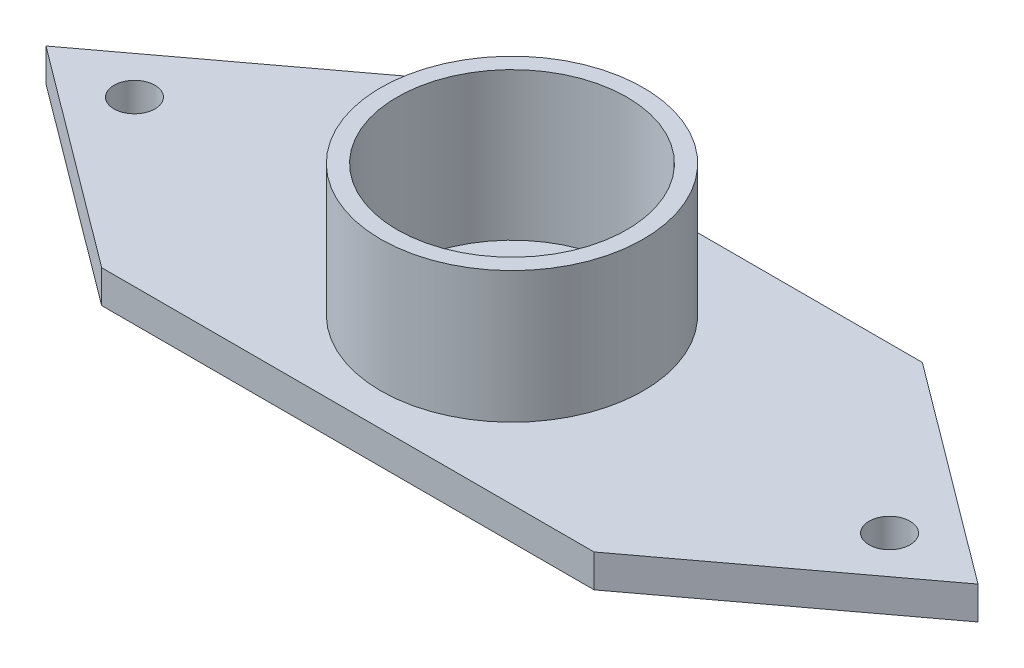
ISO-10303-21;
HEADER;
FILE_DESCRIPTION(('STEP AP214'),'2;1');
FILE_NAME('part.step','',(''),(''),'','','');
FILE_SCHEMA(('AUTOMOTIVE_DESIGN { 1 0 10303 214 1 1 1 1 }'));
ENDSEC;
DATA;
#1=APPLICATION_CONTEXT('core data for automotive mechanical design processes');
#2=APPLICATION_PROTOCOL_DEFINITION('international standard','automotive_design',2000,#1);
#3=PRODUCT_CONTEXT('',#1,'mechanical');
#4=PRODUCT('Part','Part','',(#3));
#5=PRODUCT_RELATED_PRODUCT_CATEGORY('part','',(#4));
#6=PRODUCT_DEFINITION_FORMATION('','',#4);
#7=PRODUCT_DEFINITION_CONTEXT('part definition',#1,'design');
#8=PRODUCT_DEFINITION('design','',#6,#7);
#9=PRODUCT_DEFINITION_SHAPE('','',#8);
#10=(LENGTH_UNIT() NAMED_UNIT(*) SI_UNIT(.MILLI.,.METRE.));
#11=(NAMED_UNIT(*) PLANE_ANGLE_UNIT() SI_UNIT($,.RADIAN.));
#12=(NAMED_UNIT(*) SI_UNIT($,.STERADIAN.) SOLID_ANGLE_UNIT());
#13=UNCERTAINTY_MEASURE_WITH_UNIT(LENGTH_MEASURE(1.E-05),#10,'distance_accuracy_value','');
#14=(GEOMETRIC_REPRESENTATION_CONTEXT(3) GLOBAL_UNCERTAINTY_ASSIGNED_CONTEXT((#13)) GLOBAL_UNIT_ASSIGNED_CONTEXT((#10,
#11,#12)) REPRESENTATION_CONTEXT('',''));
#15=CARTESIAN_POINT('',(0.,0.,0.));
#16=DIRECTION('',(0.,0.,1.));
#17=DIRECTION('',(1.,0.,0.));
#18=AXIS2_PLACEMENT_3D('',#15,#16,#17);
#19=CARTESIAN_POINT('',(10.7416276220772,2.,14.3828461957619));
#20=DIRECTION('',(-0.59837634818669,0.,-0.801215168310462));
#21=DIRECTION('',(-0.801215168310461,0.,0.59837634818669));
#22=AXIS2_PLACEMENT_3D('',#19,#20,#21);
#23=PLANE('',#22);
#24=DIRECTION('',(0.801215168310461,0.,-0.59837634818669));
#25=VECTOR('',#24,1.);
#26=CARTESIAN_POINT('',(10.7416276220772,0.,14.3828461957619));
#27=LINE('',#26,#25);
#28=CARTESIAN_POINT('',(30.,0.,0.));
#29=VERTEX_POINT('',#28);
#30=CARTESIAN_POINT('',(43.3898201481133,0.,-10.));
#31=VERTEX_POINT('',#30);
#32=EDGE_CURVE('E130',#29,#31,#27,.T.);
#33=ORIENTED_EDGE('',*,*,#32,.T.);
#34=DIRECTION('',(0.,-1.,0.));
#35=VECTOR('',#34,1.);
#36=CARTESIAN_POINT('',(43.3898201481133,2.,-10.));
#37=LINE('',#36,#35);
#38=CARTESIAN_POINT('',(43.3898201481133,2.,-10.));
#39=VERTEX_POINT('',#38);
#40=EDGE_CURVE('E11',#39,#31,#37,.T.);
#41=ORIENTED_EDGE('',*,*,#40,.F.);
#42=DIRECTION('',(0.801215168310461,0.,-0.59837634818669));
#43=VECTOR('',#42,1.);
#44=CARTESIAN_POINT('',(10.7416276220772,2.,14.3828461957619));
#45=LINE('',#44,#43);
#46=CARTESIAN_POINT('',(30.,2.,0.));
#47=VERTEX_POINT('',#46);
#48=EDGE_CURVE('E143',#47,#39,#45,.T.);
#49=ORIENTED_EDGE('',*,*,#48,.F.);
#50=DIRECTION('',(0.,-1.,0.));
#51=VECTOR('',#50,1.);
#52=CARTESIAN_POINT('',(30.,2.,0.));
#53=LINE('',#52,#51);
#54=EDGE_CURVE('E126',#47,#29,#53,.T.);
#55=ORIENTED_EDGE('',*,*,#54,.T.);
#56=EDGE_LOOP('',(#33,#41,#49,#55));
#57=FACE_BOUND('',#56,.T.);
#58=ADVANCED_FACE('F45',(#57),#23,.F.);
#59=CARTESIAN_POINT('',(20.3301917525851,2.,-27.2217611143772));
#60=DIRECTION('',(-0.59837634818669,0.,0.801215168310462));
#61=DIRECTION('',(0.801215168310461,0.,0.59837634818669));
#62=AXIS2_PLACEMENT_3D('',#59,#60,#61);
#63=PLANE('',#62);
#64=DIRECTION('',(-0.801215168310461,0.,-0.59837634818669));
#65=VECTOR('',#64,1.);
#66=CARTESIAN_POINT('',(20.3301917525851,0.,-27.2217611143772));
#67=LINE('',#66,#65);
#68=CARTESIAN_POINT('',(30.,0.,-20.));
#69=VERTEX_POINT('',#68);
#70=EDGE_CURVE('E133',#31,#69,#67,.T.);
#71=ORIENTED_EDGE('',*,*,#70,.T.);
#72=DIRECTION('',(0.,-1.,0.));
#73=VECTOR('',#72,1.);
#74=CARTESIAN_POINT('',(30.,2.,-20.));
#75=LINE('',#74,#73);
#76=CARTESIAN_POINT('',(30.,2.,-20.));
#77=VERTEX_POINT('',#76);
#78=EDGE_CURVE('E54',#77,#69,#75,.T.);
#79=ORIENTED_EDGE('',*,*,#78,.F.);
#80=DIRECTION('',(-0.801215168310461,0.,-0.59837634818669));
#81=VECTOR('',#80,1.);
#82=CARTESIAN_POINT('',(20.3301917525851,2.,-27.2217611143772));
#83=LINE('',#82,#81);
#84=EDGE_CURVE('E100',#39,#77,#83,.T.);
#85=ORIENTED_EDGE('',*,*,#84,.F.);
#86=ORIENTED_EDGE('',*,*,#40,.T.);
#87=EDGE_LOOP('',(#71,#79,#85,#86));
#88=FACE_BOUND('',#87,.T.);
#89=ADVANCED_FACE('F194',(#88),#63,.F.);
#90=CARTESIAN_POINT('',(0.,2.,-20.));
#91=DIRECTION('',(0.,0.,-1.));
#92=DIRECTION('',(-1.,0.,0.));
#93=AXIS2_PLACEMENT_3D('',#90,#91,#92);
#94=PLANE('',#93);
#95=DIRECTION('',(1.,0.,0.));
#96=VECTOR('',#95,1.);
#97=CARTESIAN_POINT('',(0.,0.,-20.));
#98=LINE('',#97,#96);
#99=CARTESIAN_POINT('',(0.,0.,-20.));
#100=VERTEX_POINT('',#99);
#101=EDGE_CURVE('E137',#100,#69,#98,.T.);
#102=ORIENTED_EDGE('',*,*,#101,.F.);
#103=DIRECTION('',(0.,-1.,0.));
#104=VECTOR('',#103,1.);
#105=CARTESIAN_POINT('',(0.,2.,-20.));
#106=LINE('',#105,#104);
#107=CARTESIAN_POINT('',(0.,2.,-20.));
#108=VERTEX_POINT('',#107);
#109=EDGE_CURVE('E121',#108,#100,#106,.T.);
#110=ORIENTED_EDGE('',*,*,#109,.F.);
#111=DIRECTION('',(1.,0.,0.));
#112=VECTOR('',#111,1.);
#113=CARTESIAN_POINT('',(0.,2.,-20.));
#114=LINE('',#113,#112);
#115=EDGE_CURVE('E114',#108,#77,#114,.T.);
#116=ORIENTED_EDGE('',*,*,#115,.T.);
#117=ORIENTED_EDGE('',*,*,#78,.T.);
#118=EDGE_LOOP('',(#102,#110,#116,#117));
#119=FACE_BOUND('',#118,.T.);
#120=ADVANCED_FACE('F174',(#119),#94,.T.);
#121=CARTESIAN_POINT('',(-9.58856413050796,2.,-12.8389149186152));
#122=DIRECTION('',(0.59837634818669,0.,0.801215168310462));
#123=DIRECTION('',(0.801215168310461,0.,-0.59837634818669));
#124=AXIS2_PLACEMENT_3D('',#121,#122,#123);
#125=PLANE('',#124);
#126=DIRECTION('',(-0.801215168310461,0.,0.59837634818669));
#127=VECTOR('',#126,1.);
#128=CARTESIAN_POINT('',(-9.58856413050796,0.,-12.8389149186152));
#129=LINE('',#128,#127);
#130=CARTESIAN_POINT('',(-13.3898201481133,0.,-10.));
#131=VERTEX_POINT('',#130);
#132=EDGE_CURVE('E120',#100,#131,#129,.T.);
#133=ORIENTED_EDGE('',*,*,#132,.T.);
#134=DIRECTION('',(0.,-1.,0.));
#135=VECTOR('',#134,1.);
#136=CARTESIAN_POINT('',(-13.3898201481133,2.,-10.));
#137=LINE('',#136,#135);
#138=CARTESIAN_POINT('',(-13.3898201481133,2.,-10.));
#139=VERTEX_POINT('',#138);
#140=EDGE_CURVE('E117',#139,#131,#137,.T.);
#141=ORIENTED_EDGE('',*,*,#140,.F.);
#142=DIRECTION('',(-0.801215168310461,0.,0.59837634818669));
#143=VECTOR('',#142,1.);
#144=CARTESIAN_POINT('',(-9.58856413050796,2.,-12.8389149186152));
#145=LINE('',#144,#143);
#146=EDGE_CURVE('E108',#108,#139,#145,.T.);
#147=ORIENTED_EDGE('',*,*,#146,.F.);
#148=ORIENTED_EDGE('',*,*,#109,.T.);
#149=EDGE_LOOP('',(#133,#141,#147,#148));
#150=FACE_BOUND('',#149,.T.);
#151=ADVANCED_FACE('F118',(#150),#125,.F.);
#152=CARTESIAN_POINT('',(0.,2.,0.));
#153=DIRECTION('',(0.59837634818669,0.,-0.801215168310462));
#154=DIRECTION('',(-0.801215168310461,0.,-0.59837634818669));
#155=AXIS2_PLACEMENT_3D('',#152,#153,#154);
#156=PLANE('',#155);
#157=DIRECTION('',(0.801215168310461,0.,0.59837634818669));
#158=VECTOR('',#157,1.);
#159=CARTESIAN_POINT('',(0.,0.,0.));
#160=LINE('',#159,#158);
#161=CARTESIAN_POINT('',(0.,0.,0.));
#162=VERTEX_POINT('',#161);
#163=EDGE_CURVE('E86',#131,#162,#160,.T.);
#164=ORIENTED_EDGE('',*,*,#163,.T.);
#165=DIRECTION('',(0.,-1.,0.));
#166=VECTOR('',#165,1.);
#167=CARTESIAN_POINT('',(0.,2.,0.));
#168=LINE('',#167,#166);
#169=CARTESIAN_POINT('',(0.,2.,0.));
#170=VERTEX_POINT('',#169);
#171=EDGE_CURVE('E122',#170,#162,#168,.T.);
#172=ORIENTED_EDGE('',*,*,#171,.F.);
#173=DIRECTION('',(0.801215168310461,0.,0.59837634818669));
#174=VECTOR('',#173,1.);
#175=CARTESIAN_POINT('',(0.,2.,0.));
#176=LINE('',#175,#174);
#177=EDGE_CURVE('E112',#139,#170,#176,.T.);
#178=ORIENTED_EDGE('',*,*,#177,.F.);
#179=ORIENTED_EDGE('',*,*,#140,.T.);
#180=EDGE_LOOP('',(#164,#172,#178,#179));
#181=FACE_BOUND('',#180,.T.);
#182=ADVANCED_FACE('F124',(#181),#156,.F.);
#183=CARTESIAN_POINT('',(0.,2.,0.));
#184=DIRECTION('',(0.,0.,-1.));
#185=DIRECTION('',(-1.,0.,0.));
#186=AXIS2_PLACEMENT_3D('',#183,#184,#185);
#187=PLANE('',#186);
#188=DIRECTION('',(1.,0.,0.));
#189=VECTOR('',#188,1.);
#190=CARTESIAN_POINT('',(0.,0.,0.));
#191=LINE('',#190,#189);
#192=EDGE_CURVE('E92',#162,#29,#191,.T.);
#193=ORIENTED_EDGE('',*,*,#192,.T.);
#194=ORIENTED_EDGE('',*,*,#54,.F.);
#195=DIRECTION('',(1.,0.,0.));
#196=VECTOR('',#195,1.);
#197=CARTESIAN_POINT('',(0.,2.,0.));
#198=LINE('',#197,#196);
#199=EDGE_CURVE('E63',#170,#47,#198,.T.);
#200=ORIENTED_EDGE('',*,*,#199,.F.);
#201=ORIENTED_EDGE('',*,*,#171,.T.);
#202=EDGE_LOOP('',(#193,#194,#200,#201));
#203=FACE_BOUND('',#202,.T.);
#204=ADVANCED_FACE('F181',(#203),#187,.F.);
#205=CARTESIAN_POINT('',(0.,2.,0.));
#206=DIRECTION('',(0.,1.,0.));
#207=DIRECTION('',(0.,0.,1.));
#208=AXIS2_PLACEMENT_3D('',#205,#206,#207);
#209=PLANE('',#208);
#210=CARTESIAN_POINT('',(38.,2.,-10.));
#211=DIRECTION('',(0.,1.,0.));
#212=DIRECTION('',(0.,0.,1.));
#213=AXIS2_PLACEMENT_3D('',#210,#211,#212);
#214=CIRCLE('',#213,1.25000000000001);
#215=CARTESIAN_POINT('',(38.,2.,-8.75));
#216=VERTEX_POINT('',#215);
#217=EDGE_CURVE('E161',#216,#216,#214,.T.);
#218=ORIENTED_EDGE('',*,*,#217,.F.);
#219=EDGE_LOOP('',(#218));
#220=FACE_BOUND('',#219,.T.);
#221=CARTESIAN_POINT('',(-8.00000000000001,2.,-10.));
#222=DIRECTION('',(0.,1.,0.));
#223=DIRECTION('',(0.,0.,1.));
#224=AXIS2_PLACEMENT_3D('',#221,#222,#223);
#225=CIRCLE('',#224,1.25);
#226=CARTESIAN_POINT('',(-8.00000000000001,2.,-8.75));
#227=VERTEX_POINT('',#226);
#228=EDGE_CURVE('E150',#227,#227,#225,.T.);
#229=ORIENTED_EDGE('',*,*,#228,.F.);
#230=EDGE_LOOP('',(#229));
#231=FACE_BOUND('',#230,.T.);
#232=CARTESIAN_POINT('',(15.,2.,-10.));
#233=DIRECTION('',(0.,1.,0.));
#234=DIRECTION('',(0.,0.,1.));
#235=AXIS2_PLACEMENT_3D('',#232,#233,#234);
#236=CIRCLE('',#235,8.);
#237=CARTESIAN_POINT('',(15.,2.,-2.));
#238=VERTEX_POINT('',#237);
#239=EDGE_CURVE('E166',#238,#238,#236,.T.);
#240=ORIENTED_EDGE('',*,*,#239,.F.);
#241=EDGE_LOOP('',(#240));
#242=FACE_BOUND('',#241,.T.);
#243=ORIENTED_EDGE('',*,*,#48,.T.);
#244=ORIENTED_EDGE('',*,*,#84,.T.);
#245=ORIENTED_EDGE('',*,*,#115,.F.);
#246=ORIENTED_EDGE('',*,*,#146,.T.);
#247=ORIENTED_EDGE('',*,*,#177,.T.);
#248=ORIENTED_EDGE('',*,*,#199,.T.);
#249=EDGE_LOOP('',(#243,#244,#245,#246,#247,#248));
#250=FACE_BOUND('',#249,.T.);
#251=ADVANCED_FACE('F110',(#220,#231,#242,#250),#209,.T.);
#252=CARTESIAN_POINT('',(0.,0.,0.));
#253=DIRECTION('',(0.,1.,0.));
#254=DIRECTION('',(0.,0.,1.));
#255=AXIS2_PLACEMENT_3D('',#252,#253,#254);
#256=PLANE('',#255);
#257=CARTESIAN_POINT('',(38.,0.,-10.));
#258=DIRECTION('',(0.,1.,0.));
#259=DIRECTION('',(0.,0.,1.));
#260=AXIS2_PLACEMENT_3D('',#257,#258,#259);
#261=CIRCLE('',#260,1.25000000000001);
#262=CARTESIAN_POINT('',(38.,0.,-8.75));
#263=VERTEX_POINT('',#262);
#264=EDGE_CURVE('E48',#263,#263,#261,.T.);
#265=ORIENTED_EDGE('',*,*,#264,.T.);
#266=EDGE_LOOP('',(#265));
#267=FACE_BOUND('',#266,.T.);
#268=CARTESIAN_POINT('',(-8.00000000000001,0.,-10.));
#269=DIRECTION('',(0.,1.,0.));
#270=DIRECTION('',(0.,0.,1.));
#271=AXIS2_PLACEMENT_3D('',#268,#269,#270);
#272=CIRCLE('',#271,1.25);
#273=CARTESIAN_POINT('',(-8.00000000000001,0.,-8.75));
#274=VERTEX_POINT('',#273);
#275=EDGE_CURVE('E147',#274,#274,#272,.T.);
#276=ORIENTED_EDGE('',*,*,#275,.T.);
#277=EDGE_LOOP('',(#276));
#278=FACE_BOUND('',#277,.T.);
#279=ORIENTED_EDGE('',*,*,#32,.F.);
#280=ORIENTED_EDGE('',*,*,#192,.F.);
#281=ORIENTED_EDGE('',*,*,#163,.F.);
#282=ORIENTED_EDGE('',*,*,#132,.F.);
#283=ORIENTED_EDGE('',*,*,#101,.T.);
#284=ORIENTED_EDGE('',*,*,#70,.F.);
#285=EDGE_LOOP('',(#279,#280,#281,#282,#283,#284));
#286=FACE_BOUND('',#285,.T.);
#287=ADVANCED_FACE('F177',(#267,#278,#286),#256,.F.);
#288=CARTESIAN_POINT('',(15.,10.,-10.));
#289=DIRECTION('',(0.,-1.,0.));
#290=DIRECTION('',(0.,0.,-1.));
#291=AXIS2_PLACEMENT_3D('',#288,#289,#290);
#292=CYLINDRICAL_SURFACE('',#291,8.);
#293=CARTESIAN_POINT('',(15.,10.,-10.));
#294=DIRECTION('',(0.,1.,0.));
#295=DIRECTION('',(0.,0.,1.));
#296=AXIS2_PLACEMENT_3D('',#293,#294,#295);
#297=CIRCLE('',#296,8.);
#298=CARTESIAN_POINT('',(15.,10.,-2.));
#299=VERTEX_POINT('',#298);
#300=EDGE_CURVE('E134',#299,#299,#297,.T.);
#301=ORIENTED_EDGE('',*,*,#300,.F.);
#302=EDGE_LOOP('',(#301));
#303=FACE_BOUND('',#302,.T.);
#304=ORIENTED_EDGE('',*,*,#239,.T.);
#305=EDGE_LOOP('',(#304));
#306=FACE_BOUND('',#305,.T.);
#307=ADVANCED_FACE('F240',(#303,#306),#292,.T.);
#308=CARTESIAN_POINT('',(15.,10.,-10.));
#309=DIRECTION('',(0.,1.,0.));
#310=DIRECTION('',(0.,0.,1.));
#311=AXIS2_PLACEMENT_3D('',#308,#309,#310);
#312=PLANE('',#311);
#313=CARTESIAN_POINT('',(15.,10.,-10.));
#314=DIRECTION('',(0.,1.,0.));
#315=DIRECTION('',(0.,0.,1.));
#316=AXIS2_PLACEMENT_3D('',#313,#314,#315);
#317=CIRCLE('',#316,7.);
#318=CARTESIAN_POINT('',(15.,10.,-3.));
#319=VERTEX_POINT('',#318);
#320=EDGE_CURVE('E154',#319,#319,#317,.T.);
#321=ORIENTED_EDGE('',*,*,#320,.F.);
#322=EDGE_LOOP('',(#321));
#323=FACE_BOUND('',#322,.T.);
#324=ORIENTED_EDGE('',*,*,#300,.T.);
#325=EDGE_LOOP('',(#324));
#326=FACE_BOUND('',#325,.T.);
#327=ADVANCED_FACE('F255',(#323,#326),#312,.T.);
#328=CARTESIAN_POINT('',(0.,1.,0.));
#329=DIRECTION('',(0.,1.,0.));
#330=DIRECTION('',(0.,0.,1.));
#331=AXIS2_PLACEMENT_3D('',#328,#329,#330);
#332=PLANE('',#331);
#333=CARTESIAN_POINT('',(15.,0.999999999999999,-10.));
#334=DIRECTION('',(0.,1.,0.));
#335=DIRECTION('',(0.,0.,1.));
#336=AXIS2_PLACEMENT_3D('',#333,#334,#335);
#337=CIRCLE('',#336,7.);
#338=CARTESIAN_POINT('',(15.,0.999999999999999,-3.));
#339=VERTEX_POINT('',#338);
#340=EDGE_CURVE('E149',#339,#339,#337,.T.);
#341=ORIENTED_EDGE('',*,*,#340,.T.);
#342=EDGE_LOOP('',(#341));
#343=FACE_BOUND('',#342,.T.);
#344=ADVANCED_FACE('F265',(#343),#332,.T.);
#345=CARTESIAN_POINT('',(15.,10.,-10.));
#346=DIRECTION('',(0.,-1.,0.));
#347=DIRECTION('',(0.,0.,-1.));
#348=AXIS2_PLACEMENT_3D('',#345,#346,#347);
#349=CYLINDRICAL_SURFACE('',#348,7.);
#350=ORIENTED_EDGE('',*,*,#320,.T.);
#351=EDGE_LOOP('',(#350));
#352=FACE_BOUND('',#351,.T.);
#353=ORIENTED_EDGE('',*,*,#340,.F.);
#354=EDGE_LOOP('',(#353));
#355=FACE_BOUND('',#354,.T.);
#356=ADVANCED_FACE('F275',(#352,#355),#349,.F.);
#357=CARTESIAN_POINT('',(-8.00000000000001,-6.,-10.));
#358=DIRECTION('',(0.,1.,0.));
#359=DIRECTION('',(0.,0.,1.));
#360=AXIS2_PLACEMENT_3D('',#357,#358,#359);
#361=CYLINDRICAL_SURFACE('',#360,1.25);
#362=ORIENTED_EDGE('',*,*,#228,.T.);
#363=EDGE_LOOP('',(#362));
#364=FACE_BOUND('',#363,.T.);
#365=ORIENTED_EDGE('',*,*,#275,.F.);
#366=EDGE_LOOP('',(#365));
#367=FACE_BOUND('',#366,.T.);
#368=ADVANCED_FACE('F291',(#364,#367),#361,.F.);
#369=CARTESIAN_POINT('',(38.,-6.,-10.));
#370=DIRECTION('',(0.,1.,0.));
#371=DIRECTION('',(0.,0.,1.));
#372=AXIS2_PLACEMENT_3D('',#369,#370,#371);
#373=CYLINDRICAL_SURFACE('',#372,1.25000000000001);
#374=ORIENTED_EDGE('',*,*,#217,.T.);
#375=EDGE_LOOP('',(#374));
#376=FACE_BOUND('',#375,.T.);
#377=ORIENTED_EDGE('',*,*,#264,.F.);
#378=EDGE_LOOP('',(#377));
#379=FACE_BOUND('',#378,.T.);
#380=ADVANCED_FACE('F300',(#376,#379),#373,.F.);
#381=CLOSED_SHELL('',(#58,#89,#120,#151,#182,#204,#251,#287,#307,#327,#344,#356,#368,#380));
#382=MANIFOLD_SOLID_BREP('B2',#381);
#383=ADVANCED_BREP_SHAPE_REPRESENTATION('',(#18,#382),#14);
#384=SHAPE_DEFINITION_REPRESENTATION(#9,#383);
ENDSEC;
END-ISO-10303-21;
